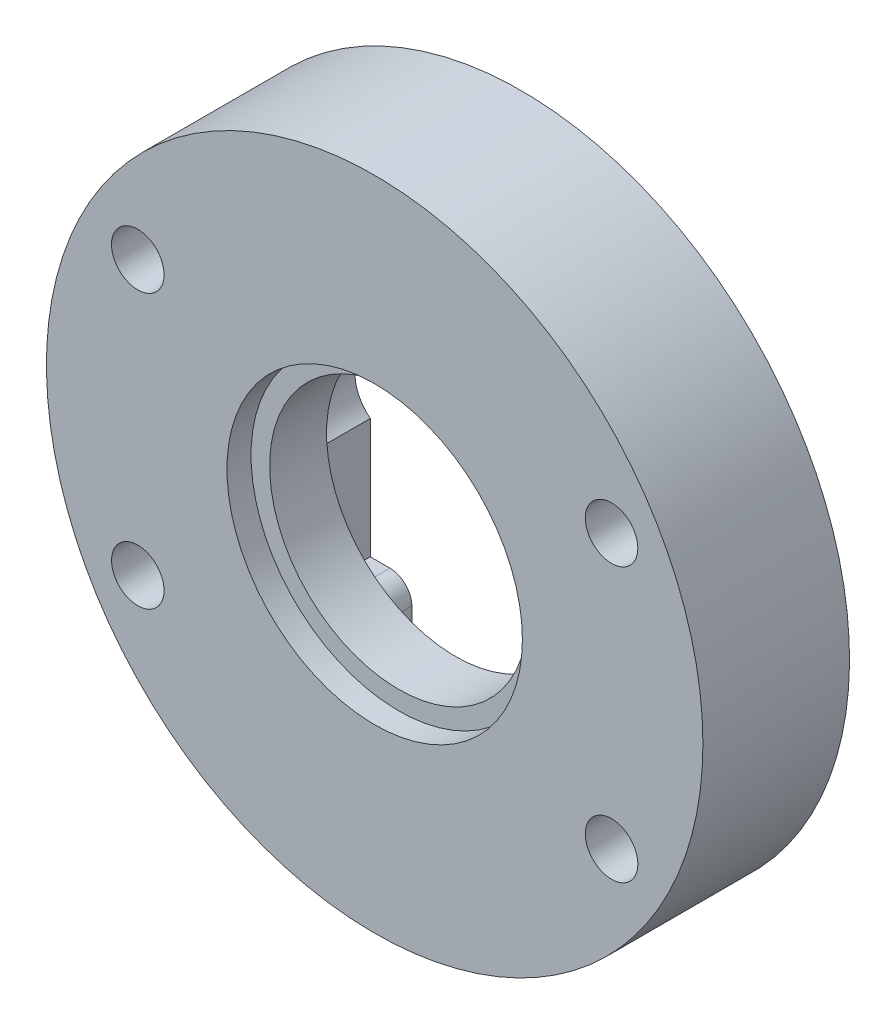
ISO-10303-21;
HEADER;
FILE_DESCRIPTION(('STEP AP214'),'2;1');
FILE_NAME('part.step','',(''),(''),'','','');
FILE_SCHEMA(('AUTOMOTIVE_DESIGN { 1 0 10303 214 1 1 1 1 }'));
ENDSEC;
DATA;
#1=APPLICATION_CONTEXT('core data for automotive mechanical design processes');
#2=APPLICATION_PROTOCOL_DEFINITION('international standard','automotive_design',2000,#1);
#3=PRODUCT_CONTEXT('',#1,'mechanical');
#4=PRODUCT('Part','Part','',(#3));
#5=PRODUCT_RELATED_PRODUCT_CATEGORY('part','',(#4));
#6=PRODUCT_DEFINITION_FORMATION('','',#4);
#7=PRODUCT_DEFINITION_CONTEXT('part definition',#1,'design');
#8=PRODUCT_DEFINITION('design','',#6,#7);
#9=PRODUCT_DEFINITION_SHAPE('','',#8);
#10=(LENGTH_UNIT() NAMED_UNIT(*) SI_UNIT(.MILLI.,.METRE.));
#11=(NAMED_UNIT(*) PLANE_ANGLE_UNIT() SI_UNIT($,.RADIAN.));
#12=(NAMED_UNIT(*) SI_UNIT($,.STERADIAN.) SOLID_ANGLE_UNIT());
#13=UNCERTAINTY_MEASURE_WITH_UNIT(LENGTH_MEASURE(1.E-05),#10,'distance_accuracy_value','');
#14=(GEOMETRIC_REPRESENTATION_CONTEXT(3) GLOBAL_UNCERTAINTY_ASSIGNED_CONTEXT((#13)) GLOBAL_UNIT_ASSIGNED_CONTEXT((#10,
#11,#12)) REPRESENTATION_CONTEXT('',''));
#15=CARTESIAN_POINT('',(0.,0.,0.));
#16=DIRECTION('',(0.,0.,1.));
#17=DIRECTION('',(1.,0.,0.));
#18=AXIS2_PLACEMENT_3D('',#15,#16,#17);
#19=CARTESIAN_POINT('',(0.,0.,5.6));
#20=DIRECTION('',(0.,0.,1.));
#21=DIRECTION('',(1.,0.,0.));
#22=AXIS2_PLACEMENT_3D('',#19,#20,#21);
#23=PLANE('',#22);
#24=CARTESIAN_POINT('',(0.,0.,5.6));
#25=DIRECTION('',(0.,0.,1.));
#26=DIRECTION('',(1.,0.,0.));
#27=AXIS2_PLACEMENT_3D('',#24,#25,#26);
#28=CIRCLE('',#27,5.9);
#29=CARTESIAN_POINT('',(5.9,0.,5.6));
#30=VERTEX_POINT('',#29);
#31=EDGE_CURVE('E337',#30,#30,#28,.T.);
#32=ORIENTED_EDGE('',*,*,#31,.F.);
#33=EDGE_LOOP('',(#32));
#34=FACE_BOUND('',#33,.T.);
#35=CARTESIAN_POINT('',(0.,0.,5.6));
#36=DIRECTION('',(0.,0.,1.));
#37=DIRECTION('',(1.,0.,0.));
#38=AXIS2_PLACEMENT_3D('',#35,#36,#37);
#39=CIRCLE('',#38,6.75);
#40=CARTESIAN_POINT('',(6.75,0.,5.6));
#41=VERTEX_POINT('',#40);
#42=EDGE_CURVE('E220',#41,#41,#39,.F.);
#43=ORIENTED_EDGE('',*,*,#42,.F.);
#44=EDGE_LOOP('',(#43));
#45=FACE_BOUND('',#44,.T.);
#46=ADVANCED_FACE('F35',(#34,#45),#23,.T.);
#47=CARTESIAN_POINT('',(6.90000000000001,-6.9,3.));
#48=DIRECTION('',(1.,0.,0.));
#49=DIRECTION('',(0.,1.,0.));
#50=AXIS2_PLACEMENT_3D('',#47,#48,#49);
#51=PLANE('',#50);
#52=DIRECTION('',(0.,-1.,0.));
#53=VECTOR('',#52,1.);
#54=CARTESIAN_POINT('',(6.90000000000001,-6.9,0.));
#55=LINE('',#54,#53);
#56=CARTESIAN_POINT('',(6.9,6.9,0.));
#57=VERTEX_POINT('',#56);
#58=CARTESIAN_POINT('',(6.9,1.4247806848775,0.));
#59=VERTEX_POINT('',#58);
#60=EDGE_CURVE('E143',#57,#59,#55,.T.);
#61=ORIENTED_EDGE('',*,*,#60,.T.);
#62=DIRECTION('',(0.,0.,1.));
#63=VECTOR('',#62,1.);
#64=CARTESIAN_POINT('',(6.9,1.4247806848775,0.));
#65=LINE('',#64,#63);
#66=CARTESIAN_POINT('',(6.9,1.4247806848775,3.));
#67=VERTEX_POINT('',#66);
#68=EDGE_CURVE('E135',#59,#67,#65,.T.);
#69=ORIENTED_EDGE('',*,*,#68,.T.);
#70=DIRECTION('',(0.,-1.,0.));
#71=VECTOR('',#70,1.);
#72=CARTESIAN_POINT('',(6.90000000000001,-6.9,3.));
#73=LINE('',#72,#71);
#74=CARTESIAN_POINT('',(6.9,6.9,3.));
#75=VERTEX_POINT('',#74);
#76=EDGE_CURVE('E140',#75,#67,#73,.T.);
#77=ORIENTED_EDGE('',*,*,#76,.F.);
#78=DIRECTION('',(0.,0.,-1.));
#79=VECTOR('',#78,1.);
#80=CARTESIAN_POINT('',(6.9,6.9,3.));
#81=LINE('',#80,#79);
#82=EDGE_CURVE('E181',#75,#57,#81,.T.);
#83=ORIENTED_EDGE('',*,*,#82,.T.);
#84=EDGE_LOOP('',(#61,#69,#77,#83));
#85=FACE_BOUND('',#84,.T.);
#86=ADVANCED_FACE('F137',(#85),#51,.F.);
#87=CARTESIAN_POINT('',(-6.9,-6.9,3.));
#88=DIRECTION('',(-1.,0.,0.));
#89=DIRECTION('',(0.,0.,1.));
#90=AXIS2_PLACEMENT_3D('',#87,#88,#89);
#91=PLANE('',#90);
#92=DIRECTION('',(0.,1.,0.));
#93=VECTOR('',#92,1.);
#94=CARTESIAN_POINT('',(-6.9,-6.9,0.));
#95=LINE('',#94,#93);
#96=CARTESIAN_POINT('',(-6.9,-6.9,0.));
#97=VERTEX_POINT('',#96);
#98=CARTESIAN_POINT('',(-6.9,-1.4247806848775,0.));
#99=VERTEX_POINT('',#98);
#100=EDGE_CURVE('E195',#97,#99,#95,.T.);
#101=ORIENTED_EDGE('',*,*,#100,.T.);
#102=DIRECTION('',(0.,0.,1.));
#103=VECTOR('',#102,1.);
#104=CARTESIAN_POINT('',(-6.9,-1.4247806848775,0.));
#105=LINE('',#104,#103);
#106=CARTESIAN_POINT('',(-6.9,-1.4247806848775,3.));
#107=VERTEX_POINT('',#106);
#108=EDGE_CURVE('E330',#99,#107,#105,.T.);
#109=ORIENTED_EDGE('',*,*,#108,.T.);
#110=DIRECTION('',(0.,1.,0.));
#111=VECTOR('',#110,1.);
#112=CARTESIAN_POINT('',(-6.9,-6.9,3.));
#113=LINE('',#112,#111);
#114=CARTESIAN_POINT('',(-6.9,-6.9,3.));
#115=VERTEX_POINT('',#114);
#116=EDGE_CURVE('E177',#115,#107,#113,.T.);
#117=ORIENTED_EDGE('',*,*,#116,.F.);
#118=DIRECTION('',(0.,0.,-1.));
#119=VECTOR('',#118,1.);
#120=CARTESIAN_POINT('',(-6.9,-6.9,3.));
#121=LINE('',#120,#119);
#122=EDGE_CURVE('E203',#115,#97,#121,.T.);
#123=ORIENTED_EDGE('',*,*,#122,.T.);
#124=EDGE_LOOP('',(#101,#109,#117,#123));
#125=FACE_BOUND('',#124,.T.);
#126=ADVANCED_FACE('F277',(#125),#91,.F.);
#127=CARTESIAN_POINT('',(6.90000000000001,-1.42478068487749,3.));
#128=VERTEX_POINT('',#127);
#129=CARTESIAN_POINT('',(6.90000000000001,-6.9,3.));
#130=VERTEX_POINT('',#129);
#131=EDGE_CURVE('E163',#128,#130,#73,.T.);
#132=ORIENTED_EDGE('',*,*,#131,.F.);
#133=DIRECTION('',(0.,0.,1.));
#134=VECTOR('',#133,1.);
#135=CARTESIAN_POINT('',(6.90000000000001,-1.42478068487749,0.));
#136=LINE('',#135,#134);
#137=CARTESIAN_POINT('',(6.90000000000001,-1.42478068487749,0.));
#138=VERTEX_POINT('',#137);
#139=EDGE_CURVE('E147',#128,#138,#136,.F.);
#140=ORIENTED_EDGE('',*,*,#139,.T.);
#141=CARTESIAN_POINT('',(6.90000000000001,-6.9,0.));
#142=VERTEX_POINT('',#141);
#143=EDGE_CURVE('E146',#138,#142,#55,.T.);
#144=ORIENTED_EDGE('',*,*,#143,.T.);
#145=DIRECTION('',(0.,0.,-1.));
#146=VECTOR('',#145,1.);
#147=CARTESIAN_POINT('',(6.90000000000001,-6.9,3.));
#148=LINE('',#147,#146);
#149=EDGE_CURVE('E212',#130,#142,#148,.T.);
#150=ORIENTED_EDGE('',*,*,#149,.F.);
#151=EDGE_LOOP('',(#132,#140,#144,#150));
#152=FACE_BOUND('',#151,.T.);
#153=ADVANCED_FACE('F279',(#152),#51,.F.);
#154=CARTESIAN_POINT('',(6.90000000000001,-6.9,3.));
#155=DIRECTION('',(0.,-1.,0.));
#156=DIRECTION('',(1.,0.,0.));
#157=AXIS2_PLACEMENT_3D('',#154,#155,#156);
#158=PLANE('',#157);
#159=DIRECTION('',(-1.,0.,0.));
#160=VECTOR('',#159,1.);
#161=CARTESIAN_POINT('',(6.90000000000001,-6.9,0.));
#162=LINE('',#161,#160);
#163=CARTESIAN_POINT('',(6.,-6.9,0.));
#164=VERTEX_POINT('',#163);
#165=EDGE_CURVE('E183',#142,#164,#162,.T.);
#166=ORIENTED_EDGE('',*,*,#165,.T.);
#167=DIRECTION('',(0.,0.,-1.));
#168=VECTOR('',#167,1.);
#169=CARTESIAN_POINT('',(6.,-6.9,3.));
#170=LINE('',#169,#168);
#171=CARTESIAN_POINT('',(6.,-6.9,3.));
#172=VERTEX_POINT('',#171);
#173=EDGE_CURVE('E50',#164,#172,#170,.F.);
#174=ORIENTED_EDGE('',*,*,#173,.T.);
#175=DIRECTION('',(-1.,0.,0.));
#176=VECTOR('',#175,1.);
#177=CARTESIAN_POINT('',(6.90000000000001,-6.9,3.));
#178=LINE('',#177,#176);
#179=EDGE_CURVE('E162',#130,#172,#178,.T.);
#180=ORIENTED_EDGE('',*,*,#179,.F.);
#181=ORIENTED_EDGE('',*,*,#149,.T.);
#182=EDGE_LOOP('',(#166,#174,#180,#181));
#183=FACE_BOUND('',#182,.T.);
#184=ADVANCED_FACE('F314',(#183),#158,.F.);
#185=CARTESIAN_POINT('',(5.,-6.9,3.));
#186=DIRECTION('',(1.,0.,0.));
#187=DIRECTION('',(0.,0.,-1.));
#188=AXIS2_PLACEMENT_3D('',#185,#186,#187);
#189=PLANE('',#188);
#190=DIRECTION('',(0.,-1.,0.));
#191=VECTOR('',#190,1.);
#192=CARTESIAN_POINT('',(5.,-6.9,3.));
#193=LINE('',#192,#191);
#194=CARTESIAN_POINT('',(5.,-7.9,3.));
#195=VERTEX_POINT('',#194);
#196=CARTESIAN_POINT('',(5.,-14.1421356237309,3.));
#197=VERTEX_POINT('',#196);
#198=EDGE_CURVE('E165',#195,#197,#193,.T.);
#199=ORIENTED_EDGE('',*,*,#198,.F.);
#200=DIRECTION('',(0.,0.,-1.));
#201=VECTOR('',#200,1.);
#202=CARTESIAN_POINT('',(5.,-7.9,3.));
#203=LINE('',#202,#201);
#204=CARTESIAN_POINT('',(5.,-7.9,0.));
#205=VERTEX_POINT('',#204);
#206=EDGE_CURVE('E232',#195,#205,#203,.T.);
#207=ORIENTED_EDGE('',*,*,#206,.T.);
#208=DIRECTION('',(0.,-1.,0.));
#209=VECTOR('',#208,1.);
#210=CARTESIAN_POINT('',(5.,-6.9,0.));
#211=LINE('',#210,#209);
#212=CARTESIAN_POINT('',(5.,-14.1421356237309,0.));
#213=VERTEX_POINT('',#212);
#214=EDGE_CURVE('E185',#205,#213,#211,.T.);
#215=ORIENTED_EDGE('',*,*,#214,.T.);
#216=DIRECTION('',(0.,0.,-1.));
#217=VECTOR('',#216,1.);
#218=CARTESIAN_POINT('',(5.,-14.1421356237309,3.));
#219=LINE('',#218,#217);
#220=EDGE_CURVE('E209',#197,#213,#219,.T.);
#221=ORIENTED_EDGE('',*,*,#220,.F.);
#222=EDGE_LOOP('',(#199,#207,#215,#221));
#223=FACE_BOUND('',#222,.T.);
#224=ADVANCED_FACE('F263',(#223),#189,.F.);
#225=CARTESIAN_POINT('',(0.,0.,3.));
#226=DIRECTION('',(0.,0.,-1.));
#227=DIRECTION('',(-1.,0.,0.));
#228=AXIS2_PLACEMENT_3D('',#225,#226,#227);
#229=CYLINDRICAL_SURFACE('',#228,15.);
#230=CARTESIAN_POINT('',(0.,0.,0.));
#231=DIRECTION('',(0.,0.,1.));
#232=DIRECTION('',(1.,0.,0.));
#233=AXIS2_PLACEMENT_3D('',#230,#231,#232);
#234=CIRCLE('',#233,15.);
#235=CARTESIAN_POINT('',(-5.00000000000001,-14.1421356237309,0.));
#236=VERTEX_POINT('',#235);
#237=EDGE_CURVE('E187',#213,#236,#234,.T.);
#238=ORIENTED_EDGE('',*,*,#237,.T.);
#239=DIRECTION('',(0.,0.,-1.));
#240=VECTOR('',#239,1.);
#241=CARTESIAN_POINT('',(-5.00000000000001,-14.1421356237309,3.));
#242=LINE('',#241,#240);
#243=CARTESIAN_POINT('',(-5.00000000000001,-14.1421356237309,3.));
#244=VERTEX_POINT('',#243);
#245=EDGE_CURVE('E206',#244,#236,#242,.T.);
#246=ORIENTED_EDGE('',*,*,#245,.F.);
#247=CARTESIAN_POINT('',(0.,0.,3.));
#248=DIRECTION('',(0.,0.,1.));
#249=DIRECTION('',(1.,0.,0.));
#250=AXIS2_PLACEMENT_3D('',#247,#248,#249);
#251=CIRCLE('',#250,15.);
#252=EDGE_CURVE('E156',#244,#197,#251,.T.);
#253=ORIENTED_EDGE('',*,*,#252,.T.);
#254=ORIENTED_EDGE('',*,*,#220,.T.);
#255=EDGE_LOOP('',(#238,#246,#253,#254));
#256=FACE_BOUND('',#255,.T.);
#257=CARTESIAN_POINT('',(0.,0.,6.7));
#258=DIRECTION('',(0.,0.,1.));
#259=DIRECTION('',(1.,0.,0.));
#260=AXIS2_PLACEMENT_3D('',#257,#258,#259);
#261=CIRCLE('',#260,15.);
#262=CARTESIAN_POINT('',(15.,0.,6.7));
#263=VERTEX_POINT('',#262);
#264=EDGE_CURVE('E341',#263,#263,#261,.T.);
#265=ORIENTED_EDGE('',*,*,#264,.F.);
#266=EDGE_LOOP('',(#265));
#267=FACE_BOUND('',#266,.T.);
#268=ADVANCED_FACE('F257',(#256,#267),#229,.T.);
#269=CARTESIAN_POINT('',(-5.,-6.9,3.));
#270=DIRECTION('',(-1.,0.,0.));
#271=DIRECTION('',(0.,-1.,0.));
#272=AXIS2_PLACEMENT_3D('',#269,#270,#271);
#273=PLANE('',#272);
#274=DIRECTION('',(0.,1.,0.));
#275=VECTOR('',#274,1.);
#276=CARTESIAN_POINT('',(-5.,-6.9,0.));
#277=LINE('',#276,#275);
#278=CARTESIAN_POINT('',(-5.,-7.9,0.));
#279=VERTEX_POINT('',#278);
#280=EDGE_CURVE('E189',#236,#279,#277,.T.);
#281=ORIENTED_EDGE('',*,*,#280,.T.);
#282=DIRECTION('',(0.,0.,-1.));
#283=VECTOR('',#282,1.);
#284=CARTESIAN_POINT('',(-5.,-7.9,3.));
#285=LINE('',#284,#283);
#286=CARTESIAN_POINT('',(-5.,-7.9,3.));
#287=VERTEX_POINT('',#286);
#288=EDGE_CURVE('E230',#279,#287,#285,.F.);
#289=ORIENTED_EDGE('',*,*,#288,.T.);
#290=DIRECTION('',(0.,1.,0.));
#291=VECTOR('',#290,1.);
#292=CARTESIAN_POINT('',(-5.,-6.9,3.));
#293=LINE('',#292,#291);
#294=EDGE_CURVE('E171',#244,#287,#293,.T.);
#295=ORIENTED_EDGE('',*,*,#294,.F.);
#296=ORIENTED_EDGE('',*,*,#245,.T.);
#297=EDGE_LOOP('',(#281,#289,#295,#296));
#298=FACE_BOUND('',#297,.T.);
#299=ADVANCED_FACE('F254',(#298),#273,.F.);
#300=CARTESIAN_POINT('',(-5.,-6.9,3.));
#301=DIRECTION('',(0.,-1.,0.));
#302=DIRECTION('',(0.,0.,-1.));
#303=AXIS2_PLACEMENT_3D('',#300,#301,#302);
#304=PLANE('',#303);
#305=DIRECTION('',(-1.,0.,0.));
#306=VECTOR('',#305,1.);
#307=CARTESIAN_POINT('',(-5.,-6.9,3.));
#308=LINE('',#307,#306);
#309=CARTESIAN_POINT('',(-6.,-6.9,3.));
#310=VERTEX_POINT('',#309);
#311=EDGE_CURVE('E174',#310,#115,#308,.T.);
#312=ORIENTED_EDGE('',*,*,#311,.F.);
#313=DIRECTION('',(0.,0.,-1.));
#314=VECTOR('',#313,1.);
#315=CARTESIAN_POINT('',(-6.,-6.9,3.));
#316=LINE('',#315,#314);
#317=CARTESIAN_POINT('',(-6.,-6.9,0.));
#318=VERTEX_POINT('',#317);
#319=EDGE_CURVE('E223',#310,#318,#316,.T.);
#320=ORIENTED_EDGE('',*,*,#319,.T.);
#321=DIRECTION('',(-1.,0.,0.));
#322=VECTOR('',#321,1.);
#323=CARTESIAN_POINT('',(-5.,-6.9,0.));
#324=LINE('',#323,#322);
#325=EDGE_CURVE('E192',#318,#97,#324,.T.);
#326=ORIENTED_EDGE('',*,*,#325,.T.);
#327=ORIENTED_EDGE('',*,*,#122,.F.);
#328=EDGE_LOOP('',(#312,#320,#326,#327));
#329=FACE_BOUND('',#328,.T.);
#330=ADVANCED_FACE('F244',(#329),#304,.F.);
#331=CARTESIAN_POINT('',(-6.9,1.4247806848775,3.));
#332=VERTEX_POINT('',#331);
#333=CARTESIAN_POINT('',(-6.9,6.9,3.));
#334=VERTEX_POINT('',#333);
#335=EDGE_CURVE('E176',#332,#334,#113,.T.);
#336=ORIENTED_EDGE('',*,*,#335,.F.);
#337=DIRECTION('',(0.,0.,1.));
#338=VECTOR('',#337,1.);
#339=CARTESIAN_POINT('',(-6.9,1.4247806848775,0.));
#340=LINE('',#339,#338);
#341=CARTESIAN_POINT('',(-6.9,1.4247806848775,0.));
#342=VERTEX_POINT('',#341);
#343=EDGE_CURVE('E329',#332,#342,#340,.F.);
#344=ORIENTED_EDGE('',*,*,#343,.T.);
#345=CARTESIAN_POINT('',(-6.9,6.9,0.));
#346=VERTEX_POINT('',#345);
#347=EDGE_CURVE('E194',#342,#346,#95,.T.);
#348=ORIENTED_EDGE('',*,*,#347,.T.);
#349=DIRECTION('',(0.,0.,-1.));
#350=VECTOR('',#349,1.);
#351=CARTESIAN_POINT('',(-6.9,6.9,3.));
#352=LINE('',#351,#350);
#353=EDGE_CURVE('E200',#334,#346,#352,.T.);
#354=ORIENTED_EDGE('',*,*,#353,.F.);
#355=EDGE_LOOP('',(#336,#344,#348,#354));
#356=FACE_BOUND('',#355,.T.);
#357=ADVANCED_FACE('F301',(#356),#91,.F.);
#358=CARTESIAN_POINT('',(6.9,6.9,3.));
#359=DIRECTION('',(0.,1.,0.));
#360=DIRECTION('',(-1.,0.,0.));
#361=AXIS2_PLACEMENT_3D('',#358,#359,#360);
#362=PLANE('',#361);
#363=DIRECTION('',(1.,0.,0.));
#364=VECTOR('',#363,1.);
#365=CARTESIAN_POINT('',(6.9,6.9,0.));
#366=LINE('',#365,#364);
#367=EDGE_CURVE('E167',#346,#57,#366,.T.);
#368=ORIENTED_EDGE('',*,*,#367,.T.);
#369=ORIENTED_EDGE('',*,*,#82,.F.);
#370=DIRECTION('',(1.,0.,0.));
#371=VECTOR('',#370,1.);
#372=CARTESIAN_POINT('',(6.9,6.9,3.));
#373=LINE('',#372,#371);
#374=EDGE_CURVE('E161',#334,#75,#373,.T.);
#375=ORIENTED_EDGE('',*,*,#374,.F.);
#376=ORIENTED_EDGE('',*,*,#353,.T.);
#377=EDGE_LOOP('',(#368,#369,#375,#376));
#378=FACE_BOUND('',#377,.T.);
#379=ADVANCED_FACE('F297',(#378),#362,.F.);
#380=CARTESIAN_POINT('',(0.,0.,0.));
#381=DIRECTION('',(0.,0.,1.));
#382=DIRECTION('',(1.,0.,0.));
#383=AXIS2_PLACEMENT_3D('',#380,#381,#382);
#384=PLANE('',#383);
#385=CARTESIAN_POINT('',(-10.8253175473055,6.24999999999998,0.));
#386=DIRECTION('',(0.,0.,1.));
#387=DIRECTION('',(-1.,0.,0.));
#388=AXIS2_PLACEMENT_3D('',#385,#386,#387);
#389=CIRCLE('',#388,1.2);
#390=CARTESIAN_POINT('',(-12.0253175473055,6.24999999999998,0.));
#391=VERTEX_POINT('',#390);
#392=EDGE_CURVE('E353',#391,#391,#389,.T.);
#393=ORIENTED_EDGE('',*,*,#392,.T.);
#394=EDGE_LOOP('',(#393));
#395=FACE_BOUND('',#394,.T.);
#396=CARTESIAN_POINT('',(10.8253175473055,-6.24999999999998,0.));
#397=DIRECTION('',(0.,0.,1.));
#398=DIRECTION('',(-1.,0.,0.));
#399=AXIS2_PLACEMENT_3D('',#396,#397,#398);
#400=CIRCLE('',#399,1.2);
#401=CARTESIAN_POINT('',(9.62531754730549,-6.24999999999998,0.));
#402=VERTEX_POINT('',#401);
#403=EDGE_CURVE('E365',#402,#402,#400,.T.);
#404=ORIENTED_EDGE('',*,*,#403,.T.);
#405=EDGE_LOOP('',(#404));
#406=FACE_BOUND('',#405,.T.);
#407=CARTESIAN_POINT('',(-10.8253175473055,-6.24999999999998,0.));
#408=DIRECTION('',(0.,0.,1.));
#409=DIRECTION('',(1.,0.,0.));
#410=AXIS2_PLACEMENT_3D('',#407,#408,#409);
#411=CIRCLE('',#410,1.2);
#412=CARTESIAN_POINT('',(-9.6253175473055,-6.24999999999998,0.));
#413=VERTEX_POINT('',#412);
#414=EDGE_CURVE('E359',#413,#413,#411,.T.);
#415=ORIENTED_EDGE('',*,*,#414,.T.);
#416=EDGE_LOOP('',(#415));
#417=FACE_BOUND('',#416,.T.);
#418=CARTESIAN_POINT('',(10.8253175473055,6.24999999999998,0.));
#419=DIRECTION('',(0.,0.,1.));
#420=DIRECTION('',(1.,0.,0.));
#421=AXIS2_PLACEMENT_3D('',#418,#419,#420);
#422=CIRCLE('',#421,1.2);
#423=CARTESIAN_POINT('',(12.0253175473055,6.24999999999998,0.));
#424=VERTEX_POINT('',#423);
#425=EDGE_CURVE('E349',#424,#424,#422,.T.);
#426=ORIENTED_EDGE('',*,*,#425,.T.);
#427=EDGE_LOOP('',(#426));
#428=FACE_BOUND('',#427,.T.);
#429=ORIENTED_EDGE('',*,*,#325,.F.);
#430=CARTESIAN_POINT('',(-6.,-7.9,0.));
#431=DIRECTION('',(0.,0.,1.));
#432=DIRECTION('',(1.,0.,0.));
#433=AXIS2_PLACEMENT_3D('',#430,#431,#432);
#434=CIRCLE('',#433,1.);
#435=EDGE_CURVE('E228',#318,#279,#434,.F.);
#436=ORIENTED_EDGE('',*,*,#435,.T.);
#437=ORIENTED_EDGE('',*,*,#280,.F.);
#438=ORIENTED_EDGE('',*,*,#237,.F.);
#439=ORIENTED_EDGE('',*,*,#214,.F.);
#440=CARTESIAN_POINT('',(6.,-7.9,0.));
#441=DIRECTION('',(0.,0.,1.));
#442=DIRECTION('',(1.,0.,0.));
#443=AXIS2_PLACEMENT_3D('',#440,#441,#442);
#444=CIRCLE('',#443,1.);
#445=EDGE_CURVE('E226',#205,#164,#444,.F.);
#446=ORIENTED_EDGE('',*,*,#445,.T.);
#447=ORIENTED_EDGE('',*,*,#165,.F.);
#448=ORIENTED_EDGE('',*,*,#143,.F.);
#449=CARTESIAN_POINT('',(5.8,0.,0.));
#450=DIRECTION('',(0.,0.,1.));
#451=DIRECTION('',(1.,0.,0.));
#452=AXIS2_PLACEMENT_3D('',#449,#450,#451);
#453=CIRCLE('',#452,1.8);
#454=EDGE_CURVE('E218',#138,#59,#453,.T.);
#455=ORIENTED_EDGE('',*,*,#454,.T.);
#456=ORIENTED_EDGE('',*,*,#60,.F.);
#457=ORIENTED_EDGE('',*,*,#367,.F.);
#458=ORIENTED_EDGE('',*,*,#347,.F.);
#459=CARTESIAN_POINT('',(-5.8,0.,0.));
#460=DIRECTION('',(0.,0.,1.));
#461=DIRECTION('',(1.,0.,0.));
#462=AXIS2_PLACEMENT_3D('',#459,#460,#461);
#463=CIRCLE('',#462,1.8);
#464=EDGE_CURVE('E215',#342,#99,#463,.T.);
#465=ORIENTED_EDGE('',*,*,#464,.T.);
#466=ORIENTED_EDGE('',*,*,#100,.F.);
#467=EDGE_LOOP('',(#429,#436,#437,#438,#439,#446,#447,#448,#455,#456,#457,#458,#465,#466));
#468=FACE_BOUND('',#467,.T.);
#469=ADVANCED_FACE('F250',(#395,#406,#417,#428,#468),#384,.F.);
#470=CARTESIAN_POINT('',(-5.8,0.,0.));
#471=DIRECTION('',(0.,0.,1.));
#472=DIRECTION('',(1.,0.,0.));
#473=AXIS2_PLACEMENT_3D('',#470,#471,#472);
#474=CYLINDRICAL_SURFACE('',#473,1.8);
#475=ORIENTED_EDGE('',*,*,#464,.F.);
#476=ORIENTED_EDGE('',*,*,#343,.F.);
#477=CARTESIAN_POINT('',(-5.8,0.,3.));
#478=DIRECTION('',(0.,0.,1.));
#479=DIRECTION('',(1.,0.,0.));
#480=AXIS2_PLACEMENT_3D('',#477,#478,#479);
#481=CIRCLE('',#480,1.8);
#482=EDGE_CURVE('E155',#332,#107,#481,.T.);
#483=ORIENTED_EDGE('',*,*,#482,.T.);
#484=ORIENTED_EDGE('',*,*,#108,.F.);
#485=EDGE_LOOP('',(#475,#476,#483,#484));
#486=FACE_BOUND('',#485,.T.);
#487=ADVANCED_FACE('F289',(#486),#474,.F.);
#488=CARTESIAN_POINT('',(5.8,0.,0.));
#489=DIRECTION('',(0.,0.,1.));
#490=DIRECTION('',(1.,0.,0.));
#491=AXIS2_PLACEMENT_3D('',#488,#489,#490);
#492=CYLINDRICAL_SURFACE('',#491,1.8);
#493=ORIENTED_EDGE('',*,*,#454,.F.);
#494=ORIENTED_EDGE('',*,*,#139,.F.);
#495=CARTESIAN_POINT('',(5.8,0.,3.));
#496=DIRECTION('',(0.,0.,1.));
#497=DIRECTION('',(1.,0.,0.));
#498=AXIS2_PLACEMENT_3D('',#495,#496,#497);
#499=CIRCLE('',#498,1.8);
#500=EDGE_CURVE('E150',#128,#67,#499,.T.);
#501=ORIENTED_EDGE('',*,*,#500,.T.);
#502=ORIENTED_EDGE('',*,*,#68,.F.);
#503=EDGE_LOOP('',(#493,#494,#501,#502));
#504=FACE_BOUND('',#503,.T.);
#505=ADVANCED_FACE('F151',(#504),#492,.F.);
#506=CARTESIAN_POINT('',(0.,0.,3.));
#507=DIRECTION('',(0.,0.,1.));
#508=DIRECTION('',(1.,0.,0.));
#509=AXIS2_PLACEMENT_3D('',#506,#507,#508);
#510=PLANE('',#509);
#511=CARTESIAN_POINT('',(0.,0.,3.));
#512=DIRECTION('',(0.,0.,1.));
#513=DIRECTION('',(1.,0.,0.));
#514=AXIS2_PLACEMENT_3D('',#511,#512,#513);
#515=CIRCLE('',#514,5.9);
#516=CARTESIAN_POINT('',(5.9,0.,3.));
#517=VERTEX_POINT('',#516);
#518=EDGE_CURVE('E338',#517,#517,#515,.T.);
#519=ORIENTED_EDGE('',*,*,#518,.T.);
#520=EDGE_LOOP('',(#519));
#521=FACE_BOUND('',#520,.T.);
#522=ORIENTED_EDGE('',*,*,#179,.T.);
#523=CARTESIAN_POINT('',(6.,-7.9,3.));
#524=DIRECTION('',(0.,0.,1.));
#525=DIRECTION('',(1.,0.,0.));
#526=AXIS2_PLACEMENT_3D('',#523,#524,#525);
#527=CIRCLE('',#526,1.);
#528=EDGE_CURVE('E11',#172,#195,#527,.T.);
#529=ORIENTED_EDGE('',*,*,#528,.T.);
#530=ORIENTED_EDGE('',*,*,#198,.T.);
#531=ORIENTED_EDGE('',*,*,#252,.F.);
#532=ORIENTED_EDGE('',*,*,#294,.T.);
#533=CARTESIAN_POINT('',(-6.,-7.9,3.));
#534=DIRECTION('',(0.,0.,1.));
#535=DIRECTION('',(1.,0.,0.));
#536=AXIS2_PLACEMENT_3D('',#533,#534,#535);
#537=CIRCLE('',#536,1.);
#538=EDGE_CURVE('E43',#287,#310,#537,.T.);
#539=ORIENTED_EDGE('',*,*,#538,.T.);
#540=ORIENTED_EDGE('',*,*,#311,.T.);
#541=ORIENTED_EDGE('',*,*,#116,.T.);
#542=ORIENTED_EDGE('',*,*,#482,.F.);
#543=ORIENTED_EDGE('',*,*,#335,.T.);
#544=ORIENTED_EDGE('',*,*,#374,.T.);
#545=ORIENTED_EDGE('',*,*,#76,.T.);
#546=ORIENTED_EDGE('',*,*,#500,.F.);
#547=ORIENTED_EDGE('',*,*,#131,.T.);
#548=EDGE_LOOP('',(#522,#529,#530,#531,#532,#539,#540,#541,#542,#543,#544,#545,#546,#547));
#549=FACE_BOUND('',#548,.T.);
#550=ADVANCED_FACE('F158',(#521,#549),#510,.F.);
#551=CARTESIAN_POINT('',(0.,0.,5.6));
#552=DIRECTION('',(0.,0.,-1.));
#553=DIRECTION('',(-1.,0.,0.));
#554=AXIS2_PLACEMENT_3D('',#551,#552,#553);
#555=CYLINDRICAL_SURFACE('',#554,5.9);
#556=ORIENTED_EDGE('',*,*,#31,.T.);
#557=EDGE_LOOP('',(#556));
#558=FACE_BOUND('',#557,.T.);
#559=ORIENTED_EDGE('',*,*,#518,.F.);
#560=EDGE_LOOP('',(#559));
#561=FACE_BOUND('',#560,.T.);
#562=ADVANCED_FACE('F284',(#558,#561),#555,.F.);
#563=CARTESIAN_POINT('',(0.,0.,6.7));
#564=DIRECTION('',(0.,0.,1.));
#565=DIRECTION('',(1.,0.,0.));
#566=AXIS2_PLACEMENT_3D('',#563,#564,#565);
#567=PLANE('',#566);
#568=CARTESIAN_POINT('',(-10.8253175473055,6.24999999999998,6.7));
#569=DIRECTION('',(0.,0.,1.));
#570=DIRECTION('',(-1.,0.,0.));
#571=AXIS2_PLACEMENT_3D('',#568,#569,#570);
#572=CIRCLE('',#571,1.2);
#573=CARTESIAN_POINT('',(-12.0253175473055,6.24999999999998,6.7));
#574=VERTEX_POINT('',#573);
#575=EDGE_CURVE('E368',#574,#574,#572,.T.);
#576=ORIENTED_EDGE('',*,*,#575,.F.);
#577=EDGE_LOOP('',(#576));
#578=FACE_BOUND('',#577,.T.);
#579=CARTESIAN_POINT('',(10.8253175473055,-6.24999999999998,6.7));
#580=DIRECTION('',(0.,0.,1.));
#581=DIRECTION('',(-1.,0.,0.));
#582=AXIS2_PLACEMENT_3D('',#579,#580,#581);
#583=CIRCLE('',#582,1.2);
#584=CARTESIAN_POINT('',(9.62531754730549,-6.24999999999998,6.7));
#585=VERTEX_POINT('',#584);
#586=EDGE_CURVE('E362',#585,#585,#583,.T.);
#587=ORIENTED_EDGE('',*,*,#586,.F.);
#588=EDGE_LOOP('',(#587));
#589=FACE_BOUND('',#588,.T.);
#590=CARTESIAN_POINT('',(-10.8253175473055,-6.24999999999998,6.7));
#591=DIRECTION('',(0.,0.,1.));
#592=DIRECTION('',(1.,0.,0.));
#593=AXIS2_PLACEMENT_3D('',#590,#591,#592);
#594=CIRCLE('',#593,1.2);
#595=CARTESIAN_POINT('',(-9.6253175473055,-6.24999999999998,6.7));
#596=VERTEX_POINT('',#595);
#597=EDGE_CURVE('E356',#596,#596,#594,.T.);
#598=ORIENTED_EDGE('',*,*,#597,.F.);
#599=EDGE_LOOP('',(#598));
#600=FACE_BOUND('',#599,.T.);
#601=CARTESIAN_POINT('',(10.8253175473055,6.24999999999998,6.7));
#602=DIRECTION('',(0.,0.,1.));
#603=DIRECTION('',(1.,0.,0.));
#604=AXIS2_PLACEMENT_3D('',#601,#602,#603);
#605=CIRCLE('',#604,1.2);
#606=CARTESIAN_POINT('',(12.0253175473055,6.24999999999998,6.7));
#607=VERTEX_POINT('',#606);
#608=EDGE_CURVE('E350',#607,#607,#605,.T.);
#609=ORIENTED_EDGE('',*,*,#608,.F.);
#610=EDGE_LOOP('',(#609));
#611=FACE_BOUND('',#610,.T.);
#612=ORIENTED_EDGE('',*,*,#264,.T.);
#613=EDGE_LOOP('',(#612));
#614=FACE_BOUND('',#613,.T.);
#615=CARTESIAN_POINT('',(0.,0.,6.7));
#616=DIRECTION('',(0.,0.,1.));
#617=DIRECTION('',(1.,0.,0.));
#618=AXIS2_PLACEMENT_3D('',#615,#616,#617);
#619=CIRCLE('',#618,6.75);
#620=CARTESIAN_POINT('',(6.75,0.,6.7));
#621=VERTEX_POINT('',#620);
#622=EDGE_CURVE('E346',#621,#621,#619,.T.);
#623=ORIENTED_EDGE('',*,*,#622,.F.);
#624=EDGE_LOOP('',(#623));
#625=FACE_BOUND('',#624,.T.);
#626=ADVANCED_FACE('F381',(#578,#589,#600,#611,#614,#625),#567,.T.);
#627=CARTESIAN_POINT('',(0.,0.,6.7));
#628=DIRECTION('',(0.,0.,-1.));
#629=DIRECTION('',(-1.,0.,0.));
#630=AXIS2_PLACEMENT_3D('',#627,#628,#629);
#631=CYLINDRICAL_SURFACE('',#630,6.75);
#632=ORIENTED_EDGE('',*,*,#622,.T.);
#633=EDGE_LOOP('',(#632));
#634=FACE_BOUND('',#633,.T.);
#635=ORIENTED_EDGE('',*,*,#42,.T.);
#636=EDGE_LOOP('',(#635));
#637=FACE_BOUND('',#636,.T.);
#638=ADVANCED_FACE('F384',(#634,#637),#631,.F.);
#639=CARTESIAN_POINT('',(10.8253175473055,6.24999999999998,0.));
#640=DIRECTION('',(0.,0.,1.));
#641=DIRECTION('',(1.,0.,0.));
#642=AXIS2_PLACEMENT_3D('',#639,#640,#641);
#643=CYLINDRICAL_SURFACE('',#642,1.2);
#644=ORIENTED_EDGE('',*,*,#425,.F.);
#645=EDGE_LOOP('',(#644));
#646=FACE_BOUND('',#645,.T.);
#647=ORIENTED_EDGE('',*,*,#608,.T.);
#648=EDGE_LOOP('',(#647));
#649=FACE_BOUND('',#648,.T.);
#650=ADVANCED_FACE('F397',(#646,#649),#643,.F.);
#651=CARTESIAN_POINT('',(-10.8253175473055,-6.24999999999998,0.));
#652=DIRECTION('',(0.,0.,1.));
#653=DIRECTION('',(1.,0.,0.));
#654=AXIS2_PLACEMENT_3D('',#651,#652,#653);
#655=CYLINDRICAL_SURFACE('',#654,1.2);
#656=ORIENTED_EDGE('',*,*,#414,.F.);
#657=EDGE_LOOP('',(#656));
#658=FACE_BOUND('',#657,.T.);
#659=ORIENTED_EDGE('',*,*,#597,.T.);
#660=EDGE_LOOP('',(#659));
#661=FACE_BOUND('',#660,.T.);
#662=ADVANCED_FACE('F403',(#658,#661),#655,.F.);
#663=CARTESIAN_POINT('',(10.8253175473055,-6.24999999999998,0.));
#664=DIRECTION('',(0.,0.,1.));
#665=DIRECTION('',(1.,0.,0.));
#666=AXIS2_PLACEMENT_3D('',#663,#664,#665);
#667=CYLINDRICAL_SURFACE('',#666,1.2);
#668=ORIENTED_EDGE('',*,*,#403,.F.);
#669=EDGE_LOOP('',(#668));
#670=FACE_BOUND('',#669,.T.);
#671=ORIENTED_EDGE('',*,*,#586,.T.);
#672=EDGE_LOOP('',(#671));
#673=FACE_BOUND('',#672,.T.);
#674=ADVANCED_FACE('F377',(#670,#673),#667,.F.);
#675=CARTESIAN_POINT('',(-10.8253175473055,6.24999999999998,0.));
#676=DIRECTION('',(0.,0.,1.));
#677=DIRECTION('',(1.,0.,0.));
#678=AXIS2_PLACEMENT_3D('',#675,#676,#677);
#679=CYLINDRICAL_SURFACE('',#678,1.2);
#680=ORIENTED_EDGE('',*,*,#392,.F.);
#681=EDGE_LOOP('',(#680));
#682=FACE_BOUND('',#681,.T.);
#683=ORIENTED_EDGE('',*,*,#575,.T.);
#684=EDGE_LOOP('',(#683));
#685=FACE_BOUND('',#684,.T.);
#686=ADVANCED_FACE('F270',(#682,#685),#679,.F.);
#687=CARTESIAN_POINT('',(-6.,-7.9,3.));
#688=DIRECTION('',(0.,0.,-1.));
#689=DIRECTION('',(-1.,0.,0.));
#690=AXIS2_PLACEMENT_3D('',#687,#688,#689);
#691=CYLINDRICAL_SURFACE('',#690,1.);
#692=ORIENTED_EDGE('',*,*,#538,.F.);
#693=ORIENTED_EDGE('',*,*,#288,.F.);
#694=ORIENTED_EDGE('',*,*,#435,.F.);
#695=ORIENTED_EDGE('',*,*,#319,.F.);
#696=EDGE_LOOP('',(#692,#693,#694,#695));
#697=FACE_BOUND('',#696,.T.);
#698=ADVANCED_FACE('F247',(#697),#691,.T.);
#699=CARTESIAN_POINT('',(6.,-7.9,3.));
#700=DIRECTION('',(0.,0.,-1.));
#701=DIRECTION('',(-1.,0.,0.));
#702=AXIS2_PLACEMENT_3D('',#699,#700,#701);
#703=CYLINDRICAL_SURFACE('',#702,1.);
#704=ORIENTED_EDGE('',*,*,#528,.F.);
#705=ORIENTED_EDGE('',*,*,#173,.F.);
#706=ORIENTED_EDGE('',*,*,#445,.F.);
#707=ORIENTED_EDGE('',*,*,#206,.F.);
#708=EDGE_LOOP('',(#704,#705,#706,#707));
#709=FACE_BOUND('',#708,.T.);
#710=ADVANCED_FACE('F37',(#709),#703,.T.);
#711=CLOSED_SHELL('',(#46,#86,#126,#153,#184,#224,#268,#299,#330,#357,#379,#469,#487,#505,#550,
#562,#626,#638,#650,#662,#674,#686,#698,#710));
#712=MANIFOLD_SOLID_BREP('B2',#711);
#713=ADVANCED_BREP_SHAPE_REPRESENTATION('',(#18,#712),#14);
#714=SHAPE_DEFINITION_REPRESENTATION(#9,#713);
ENDSEC;
END-ISO-10303-21;
